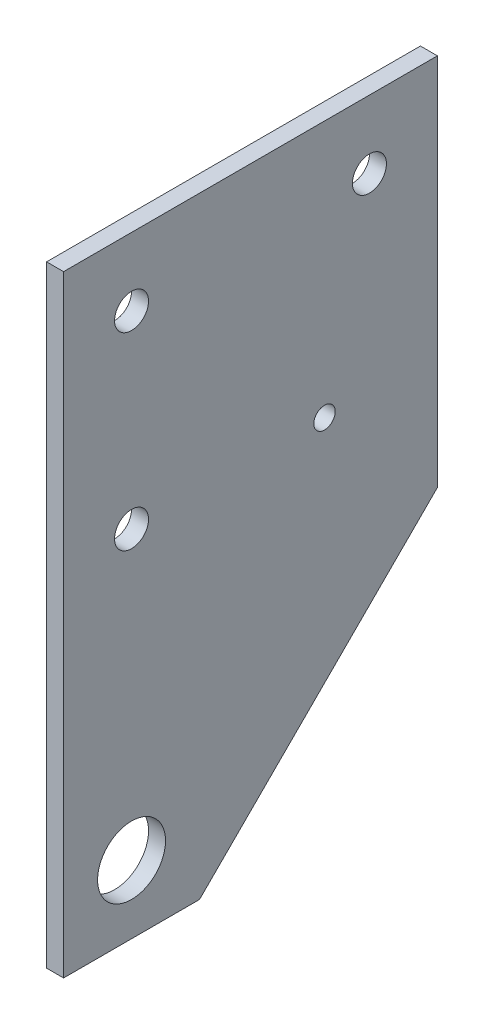
ISO-10303-21;
HEADER;
FILE_DESCRIPTION(('STEP AP214'),'2;1');
FILE_NAME('part.step','',(''),(''),'','','');
FILE_SCHEMA(('AUTOMOTIVE_DESIGN { 1 0 10303 214 1 1 1 1 }'));
ENDSEC;
DATA;
#1=APPLICATION_CONTEXT('core data for automotive mechanical design processes');
#2=APPLICATION_PROTOCOL_DEFINITION('international standard','automotive_design',2000,#1);
#3=PRODUCT_CONTEXT('',#1,'mechanical');
#4=PRODUCT('Part','Part','',(#3));
#5=PRODUCT_RELATED_PRODUCT_CATEGORY('part','',(#4));
#6=PRODUCT_DEFINITION_FORMATION('','',#4);
#7=PRODUCT_DEFINITION_CONTEXT('part definition',#1,'design');
#8=PRODUCT_DEFINITION('design','',#6,#7);
#9=PRODUCT_DEFINITION_SHAPE('','',#8);
#10=(LENGTH_UNIT() NAMED_UNIT(*) SI_UNIT(.MILLI.,.METRE.));
#11=(NAMED_UNIT(*) PLANE_ANGLE_UNIT() SI_UNIT($,.RADIAN.));
#12=(NAMED_UNIT(*) SI_UNIT($,.STERADIAN.) SOLID_ANGLE_UNIT());
#13=UNCERTAINTY_MEASURE_WITH_UNIT(LENGTH_MEASURE(1.E-05),#10,'distance_accuracy_value','');
#14=(GEOMETRIC_REPRESENTATION_CONTEXT(3) GLOBAL_UNCERTAINTY_ASSIGNED_CONTEXT((#13)) GLOBAL_UNIT_ASSIGNED_CONTEXT((#10,
#11,#12)) REPRESENTATION_CONTEXT('',''));
#15=CARTESIAN_POINT('',(0.,0.,0.));
#16=DIRECTION('',(0.,0.,1.));
#17=DIRECTION('',(1.,0.,0.));
#18=AXIS2_PLACEMENT_3D('',#15,#16,#17);
#19=CARTESIAN_POINT('',(3.175,-12.7,12.7));
#20=DIRECTION('',(1.,0.,0.));
#21=DIRECTION('',(0.,0.,-1.));
#22=AXIS2_PLACEMENT_3D('',#19,#20,#21);
#23=PLANE('',#22);
#24=CARTESIAN_POINT('',(3.175,88.9,-44.45));
#25=DIRECTION('',(1.,0.,0.));
#26=DIRECTION('',(0.,0.,-1.));
#27=AXIS2_PLACEMENT_3D('',#24,#25,#26);
#28=CIRCLE('',#27,3.175);
#29=CARTESIAN_POINT('',(3.175,88.9,-47.625));
#30=VERTEX_POINT('',#29);
#31=EDGE_CURVE('E177',#30,#30,#28,.T.);
#32=ORIENTED_EDGE('',*,*,#31,.F.);
#33=EDGE_LOOP('',(#32));
#34=FACE_BOUND('',#33,.T.);
#35=CARTESIAN_POINT('',(3.175,0.,0.));
#36=DIRECTION('',(1.,0.,0.));
#37=DIRECTION('',(0.,0.,-1.));
#38=AXIS2_PLACEMENT_3D('',#35,#36,#37);
#39=CIRCLE('',#38,6.35000000000008);
#40=CARTESIAN_POINT('',(3.175,0.,-6.35000000000008));
#41=VERTEX_POINT('',#40);
#42=EDGE_CURVE('E189',#41,#41,#39,.T.);
#43=ORIENTED_EDGE('',*,*,#42,.F.);
#44=EDGE_LOOP('',(#43));
#45=FACE_BOUND('',#44,.T.);
#46=DIRECTION('',(0.,-1.,0.));
#47=VECTOR('',#46,1.);
#48=CARTESIAN_POINT('',(3.175,101.6,12.7));
#49=LINE('',#48,#47);
#50=CARTESIAN_POINT('',(3.175,101.6,12.7));
#51=VERTEX_POINT('',#50);
#52=CARTESIAN_POINT('',(3.175,-12.7,12.7));
#53=VERTEX_POINT('',#52);
#54=EDGE_CURVE('E117',#51,#53,#49,.T.);
#55=ORIENTED_EDGE('',*,*,#54,.T.);
#56=DIRECTION('',(0.,0.,-1.));
#57=VECTOR('',#56,1.);
#58=CARTESIAN_POINT('',(3.175,-12.7,12.7));
#59=LINE('',#58,#57);
#60=CARTESIAN_POINT('',(3.175,-12.7,-12.7));
#61=VERTEX_POINT('',#60);
#62=EDGE_CURVE('E84',#53,#61,#59,.T.);
#63=ORIENTED_EDGE('',*,*,#62,.T.);
#64=DIRECTION('',(0.,0.707106781186548,-0.707106781186547));
#65=VECTOR('',#64,1.);
#66=CARTESIAN_POINT('',(3.175,-12.7,-12.7));
#67=LINE('',#66,#65);
#68=CARTESIAN_POINT('',(3.175,31.75,-57.15));
#69=VERTEX_POINT('',#68);
#70=EDGE_CURVE('E88',#61,#69,#67,.T.);
#71=ORIENTED_EDGE('',*,*,#70,.T.);
#72=DIRECTION('',(0.,1.,0.));
#73=VECTOR('',#72,1.);
#74=CARTESIAN_POINT('',(3.175,31.75,-57.15));
#75=LINE('',#74,#73);
#76=CARTESIAN_POINT('',(3.175,101.6,-57.15));
#77=VERTEX_POINT('',#76);
#78=EDGE_CURVE('E92',#69,#77,#75,.T.);
#79=ORIENTED_EDGE('',*,*,#78,.T.);
#80=DIRECTION('',(0.,0.,1.));
#81=VECTOR('',#80,1.);
#82=CARTESIAN_POINT('',(3.175,101.6,12.7));
#83=LINE('',#82,#81);
#84=EDGE_CURVE('E50',#77,#51,#83,.T.);
#85=ORIENTED_EDGE('',*,*,#84,.T.);
#86=EDGE_LOOP('',(#55,#63,#71,#79,#85));
#87=FACE_BOUND('',#86,.T.);
#88=CARTESIAN_POINT('',(3.175,53.6010427405374,-36.0553));
#89=DIRECTION('',(1.,0.,0.));
#90=DIRECTION('',(0.,0.,-1.));
#91=AXIS2_PLACEMENT_3D('',#88,#89,#90);
#92=CIRCLE('',#91,2.);
#93=CARTESIAN_POINT('',(3.175,53.6010427405374,-38.0553));
#94=VERTEX_POINT('',#93);
#95=EDGE_CURVE('E112',#94,#94,#92,.T.);
#96=ORIENTED_EDGE('',*,*,#95,.F.);
#97=EDGE_LOOP('',(#96));
#98=FACE_BOUND('',#97,.T.);
#99=CARTESIAN_POINT('',(3.175,88.9,0.));
#100=DIRECTION('',(1.,0.,0.));
#101=DIRECTION('',(0.,0.,-1.));
#102=AXIS2_PLACEMENT_3D('',#99,#100,#101);
#103=CIRCLE('',#102,3.175);
#104=CARTESIAN_POINT('',(3.175,88.9,-3.17499999999999));
#105=VERTEX_POINT('',#104);
#106=EDGE_CURVE('E183',#105,#105,#103,.T.);
#107=ORIENTED_EDGE('',*,*,#106,.F.);
#108=EDGE_LOOP('',(#107));
#109=FACE_BOUND('',#108,.T.);
#110=CARTESIAN_POINT('',(3.175,53.6010427405363,0.));
#111=DIRECTION('',(1.,0.,0.));
#112=DIRECTION('',(0.,0.,-1.));
#113=AXIS2_PLACEMENT_3D('',#110,#111,#112);
#114=CIRCLE('',#113,3.175);
#115=CARTESIAN_POINT('',(3.175,53.6010427405363,-3.175));
#116=VERTEX_POINT('',#115);
#117=EDGE_CURVE('E168',#116,#116,#114,.T.);
#118=ORIENTED_EDGE('',*,*,#117,.F.);
#119=EDGE_LOOP('',(#118));
#120=FACE_BOUND('',#119,.T.);
#121=ADVANCED_FACE('F33',(#34,#45,#87,#98,#109,#120),#23,.T.);
#122=CARTESIAN_POINT('',(0.,-12.7,12.7));
#123=DIRECTION('',(1.,0.,0.));
#124=DIRECTION('',(0.,0.,-1.));
#125=AXIS2_PLACEMENT_3D('',#122,#123,#124);
#126=PLANE('',#125);
#127=CARTESIAN_POINT('',(0.,88.9,-44.45));
#128=DIRECTION('',(1.,0.,0.));
#129=DIRECTION('',(0.,0.,-1.));
#130=AXIS2_PLACEMENT_3D('',#127,#128,#129);
#131=CIRCLE('',#130,3.175);
#132=CARTESIAN_POINT('',(0.,88.9,-47.625));
#133=VERTEX_POINT('',#132);
#134=EDGE_CURVE('E174',#133,#133,#131,.T.);
#135=ORIENTED_EDGE('',*,*,#134,.T.);
#136=EDGE_LOOP('',(#135));
#137=FACE_BOUND('',#136,.T.);
#138=CARTESIAN_POINT('',(0.,0.,0.));
#139=DIRECTION('',(1.,0.,0.));
#140=DIRECTION('',(0.,0.,-1.));
#141=AXIS2_PLACEMENT_3D('',#138,#139,#140);
#142=CIRCLE('',#141,6.35000000000008);
#143=CARTESIAN_POINT('',(0.,0.,-6.35000000000008));
#144=VERTEX_POINT('',#143);
#145=EDGE_CURVE('E186',#144,#144,#142,.T.);
#146=ORIENTED_EDGE('',*,*,#145,.T.);
#147=EDGE_LOOP('',(#146));
#148=FACE_BOUND('',#147,.T.);
#149=DIRECTION('',(0.,-1.,0.));
#150=VECTOR('',#149,1.);
#151=CARTESIAN_POINT('',(0.,101.6,12.7));
#152=LINE('',#151,#150);
#153=CARTESIAN_POINT('',(0.,101.6,12.7));
#154=VERTEX_POINT('',#153);
#155=CARTESIAN_POINT('',(0.,-12.7,12.7));
#156=VERTEX_POINT('',#155);
#157=EDGE_CURVE('E108',#154,#156,#152,.T.);
#158=ORIENTED_EDGE('',*,*,#157,.F.);
#159=DIRECTION('',(0.,0.,1.));
#160=VECTOR('',#159,1.);
#161=CARTESIAN_POINT('',(0.,101.6,12.7));
#162=LINE('',#161,#160);
#163=CARTESIAN_POINT('',(0.,101.6,-57.15));
#164=VERTEX_POINT('',#163);
#165=EDGE_CURVE('E76',#164,#154,#162,.T.);
#166=ORIENTED_EDGE('',*,*,#165,.F.);
#167=DIRECTION('',(0.,1.,0.));
#168=VECTOR('',#167,1.);
#169=CARTESIAN_POINT('',(0.,31.75,-57.15));
#170=LINE('',#169,#168);
#171=CARTESIAN_POINT('',(0.,31.75,-57.15));
#172=VERTEX_POINT('',#171);
#173=EDGE_CURVE('E70',#172,#164,#170,.T.);
#174=ORIENTED_EDGE('',*,*,#173,.F.);
#175=DIRECTION('',(0.,0.707106781186548,-0.707106781186547));
#176=VECTOR('',#175,1.);
#177=CARTESIAN_POINT('',(0.,-12.7,-12.7));
#178=LINE('',#177,#176);
#179=CARTESIAN_POINT('',(0.,-12.7,-12.7));
#180=VERTEX_POINT('',#179);
#181=EDGE_CURVE('E99',#180,#172,#178,.T.);
#182=ORIENTED_EDGE('',*,*,#181,.F.);
#183=DIRECTION('',(0.,0.,-1.));
#184=VECTOR('',#183,1.);
#185=CARTESIAN_POINT('',(0.,-12.7,12.7));
#186=LINE('',#185,#184);
#187=EDGE_CURVE('E111',#156,#180,#186,.T.);
#188=ORIENTED_EDGE('',*,*,#187,.F.);
#189=EDGE_LOOP('',(#158,#166,#174,#182,#188));
#190=FACE_BOUND('',#189,.T.);
#191=CARTESIAN_POINT('',(0.,53.6010427405374,-36.0553));
#192=DIRECTION('',(1.,0.,0.));
#193=DIRECTION('',(0.,0.,-1.));
#194=AXIS2_PLACEMENT_3D('',#191,#192,#193);
#195=CIRCLE('',#194,2.);
#196=CARTESIAN_POINT('',(0.,53.6010427405374,-38.0553));
#197=VERTEX_POINT('',#196);
#198=EDGE_CURVE('E192',#197,#197,#195,.T.);
#199=ORIENTED_EDGE('',*,*,#198,.T.);
#200=EDGE_LOOP('',(#199));
#201=FACE_BOUND('',#200,.T.);
#202=CARTESIAN_POINT('',(0.,88.9,0.));
#203=DIRECTION('',(1.,0.,0.));
#204=DIRECTION('',(0.,0.,-1.));
#205=AXIS2_PLACEMENT_3D('',#202,#203,#204);
#206=CIRCLE('',#205,3.175);
#207=CARTESIAN_POINT('',(0.,88.9,-3.17499999999999));
#208=VERTEX_POINT('',#207);
#209=EDGE_CURVE('E180',#208,#208,#206,.T.);
#210=ORIENTED_EDGE('',*,*,#209,.T.);
#211=EDGE_LOOP('',(#210));
#212=FACE_BOUND('',#211,.T.);
#213=CARTESIAN_POINT('',(0.,53.6010427405363,0.));
#214=DIRECTION('',(1.,0.,0.));
#215=DIRECTION('',(0.,0.,-1.));
#216=AXIS2_PLACEMENT_3D('',#213,#214,#215);
#217=CIRCLE('',#216,3.175);
#218=CARTESIAN_POINT('',(0.,53.6010427405363,-3.175));
#219=VERTEX_POINT('',#218);
#220=EDGE_CURVE('E171',#219,#219,#217,.T.);
#221=ORIENTED_EDGE('',*,*,#220,.T.);
#222=EDGE_LOOP('',(#221));
#223=FACE_BOUND('',#222,.T.);
#224=ADVANCED_FACE('F121',(#137,#148,#190,#201,#212,#223),#126,.F.);
#225=CARTESIAN_POINT('',(3.175,101.6,12.7));
#226=DIRECTION('',(0.,0.,-1.));
#227=DIRECTION('',(0.,1.,0.));
#228=AXIS2_PLACEMENT_3D('',#225,#226,#227);
#229=PLANE('',#228);
#230=ORIENTED_EDGE('',*,*,#157,.T.);
#231=DIRECTION('',(-1.,0.,0.));
#232=VECTOR('',#231,1.);
#233=CARTESIAN_POINT('',(3.175,-12.7,12.7));
#234=LINE('',#233,#232);
#235=EDGE_CURVE('E11',#53,#156,#234,.T.);
#236=ORIENTED_EDGE('',*,*,#235,.F.);
#237=ORIENTED_EDGE('',*,*,#54,.F.);
#238=DIRECTION('',(-1.,0.,0.));
#239=VECTOR('',#238,1.);
#240=CARTESIAN_POINT('',(3.175,101.6,12.7));
#241=LINE('',#240,#239);
#242=EDGE_CURVE('E104',#51,#154,#241,.T.);
#243=ORIENTED_EDGE('',*,*,#242,.T.);
#244=EDGE_LOOP('',(#230,#236,#237,#243));
#245=FACE_BOUND('',#244,.T.);
#246=ADVANCED_FACE('F35',(#245),#229,.F.);
#247=CARTESIAN_POINT('',(3.175,-12.7,12.7));
#248=DIRECTION('',(0.,1.,0.));
#249=DIRECTION('',(0.,0.,1.));
#250=AXIS2_PLACEMENT_3D('',#247,#248,#249);
#251=PLANE('',#250);
#252=ORIENTED_EDGE('',*,*,#187,.T.);
#253=DIRECTION('',(-1.,0.,0.));
#254=VECTOR('',#253,1.);
#255=CARTESIAN_POINT('',(3.175,-12.7,-12.7));
#256=LINE('',#255,#254);
#257=EDGE_CURVE('E42',#61,#180,#256,.T.);
#258=ORIENTED_EDGE('',*,*,#257,.F.);
#259=ORIENTED_EDGE('',*,*,#62,.F.);
#260=ORIENTED_EDGE('',*,*,#235,.T.);
#261=EDGE_LOOP('',(#252,#258,#259,#260));
#262=FACE_BOUND('',#261,.T.);
#263=ADVANCED_FACE('F249',(#262),#251,.F.);
#264=CARTESIAN_POINT('',(3.175,-12.7,-12.7));
#265=DIRECTION('',(0.,0.707106781186547,0.707106781186548));
#266=DIRECTION('',(0.,-0.707106781186548,0.707106781186547));
#267=AXIS2_PLACEMENT_3D('',#264,#265,#266);
#268=PLANE('',#267);
#269=ORIENTED_EDGE('',*,*,#181,.T.);
#270=DIRECTION('',(-1.,0.,0.));
#271=VECTOR('',#270,1.);
#272=CARTESIAN_POINT('',(3.175,31.75,-57.15));
#273=LINE('',#272,#271);
#274=EDGE_CURVE('E96',#69,#172,#273,.T.);
#275=ORIENTED_EDGE('',*,*,#274,.F.);
#276=ORIENTED_EDGE('',*,*,#70,.F.);
#277=ORIENTED_EDGE('',*,*,#257,.T.);
#278=EDGE_LOOP('',(#269,#275,#276,#277));
#279=FACE_BOUND('',#278,.T.);
#280=ADVANCED_FACE('F97',(#279),#268,.F.);
#281=CARTESIAN_POINT('',(3.175,31.75,-57.15));
#282=DIRECTION('',(0.,0.,1.));
#283=DIRECTION('',(1.,0.,0.));
#284=AXIS2_PLACEMENT_3D('',#281,#282,#283);
#285=PLANE('',#284);
#286=ORIENTED_EDGE('',*,*,#173,.T.);
#287=DIRECTION('',(-1.,0.,0.));
#288=VECTOR('',#287,1.);
#289=CARTESIAN_POINT('',(3.175,101.6,-57.15));
#290=LINE('',#289,#288);
#291=EDGE_CURVE('E100',#77,#164,#290,.T.);
#292=ORIENTED_EDGE('',*,*,#291,.F.);
#293=ORIENTED_EDGE('',*,*,#78,.F.);
#294=ORIENTED_EDGE('',*,*,#274,.T.);
#295=EDGE_LOOP('',(#286,#292,#293,#294));
#296=FACE_BOUND('',#295,.T.);
#297=ADVANCED_FACE('F102',(#296),#285,.F.);
#298=CARTESIAN_POINT('',(3.175,101.6,12.7));
#299=DIRECTION('',(0.,-1.,0.));
#300=DIRECTION('',(0.,0.,-1.));
#301=AXIS2_PLACEMENT_3D('',#298,#299,#300);
#302=PLANE('',#301);
#303=ORIENTED_EDGE('',*,*,#165,.T.);
#304=ORIENTED_EDGE('',*,*,#242,.F.);
#305=ORIENTED_EDGE('',*,*,#84,.F.);
#306=ORIENTED_EDGE('',*,*,#291,.T.);
#307=EDGE_LOOP('',(#303,#304,#305,#306));
#308=FACE_BOUND('',#307,.T.);
#309=ADVANCED_FACE('F126',(#308),#302,.F.);
#310=CARTESIAN_POINT('',(3.175,53.6010427405374,-36.0553));
#311=DIRECTION('',(-1.,0.,0.));
#312=DIRECTION('',(0.,0.,1.));
#313=AXIS2_PLACEMENT_3D('',#310,#311,#312);
#314=CYLINDRICAL_SURFACE('',#313,2.);
#315=ORIENTED_EDGE('',*,*,#95,.T.);
#316=EDGE_LOOP('',(#315));
#317=FACE_BOUND('',#316,.T.);
#318=ORIENTED_EDGE('',*,*,#198,.F.);
#319=EDGE_LOOP('',(#318));
#320=FACE_BOUND('',#319,.T.);
#321=ADVANCED_FACE('F128',(#317,#320),#314,.F.);
#322=CARTESIAN_POINT('',(3.175,0.,0.));
#323=DIRECTION('',(-1.,0.,0.));
#324=DIRECTION('',(0.,0.,1.));
#325=AXIS2_PLACEMENT_3D('',#322,#323,#324);
#326=CYLINDRICAL_SURFACE('',#325,6.35000000000008);
#327=ORIENTED_EDGE('',*,*,#42,.T.);
#328=EDGE_LOOP('',(#327));
#329=FACE_BOUND('',#328,.T.);
#330=ORIENTED_EDGE('',*,*,#145,.F.);
#331=EDGE_LOOP('',(#330));
#332=FACE_BOUND('',#331,.T.);
#333=ADVANCED_FACE('F134',(#329,#332),#326,.F.);
#334=CARTESIAN_POINT('',(3.175,88.9,0.));
#335=DIRECTION('',(-1.,0.,0.));
#336=DIRECTION('',(0.,0.,1.));
#337=AXIS2_PLACEMENT_3D('',#334,#335,#336);
#338=CYLINDRICAL_SURFACE('',#337,3.175);
#339=ORIENTED_EDGE('',*,*,#106,.T.);
#340=EDGE_LOOP('',(#339));
#341=FACE_BOUND('',#340,.T.);
#342=ORIENTED_EDGE('',*,*,#209,.F.);
#343=EDGE_LOOP('',(#342));
#344=FACE_BOUND('',#343,.T.);
#345=ADVANCED_FACE('F151',(#341,#344),#338,.F.);
#346=CARTESIAN_POINT('',(3.175,88.9,-44.45));
#347=DIRECTION('',(-1.,0.,0.));
#348=DIRECTION('',(0.,0.,1.));
#349=AXIS2_PLACEMENT_3D('',#346,#347,#348);
#350=CYLINDRICAL_SURFACE('',#349,3.175);
#351=ORIENTED_EDGE('',*,*,#31,.T.);
#352=EDGE_LOOP('',(#351));
#353=FACE_BOUND('',#352,.T.);
#354=ORIENTED_EDGE('',*,*,#134,.F.);
#355=EDGE_LOOP('',(#354));
#356=FACE_BOUND('',#355,.T.);
#357=ADVANCED_FACE('F155',(#353,#356),#350,.F.);
#358=CARTESIAN_POINT('',(3.175,53.6010427405363,0.));
#359=DIRECTION('',(-1.,0.,0.));
#360=DIRECTION('',(0.,0.,1.));
#361=AXIS2_PLACEMENT_3D('',#358,#359,#360);
#362=CYLINDRICAL_SURFACE('',#361,3.175);
#363=ORIENTED_EDGE('',*,*,#117,.T.);
#364=EDGE_LOOP('',(#363));
#365=FACE_BOUND('',#364,.T.);
#366=ORIENTED_EDGE('',*,*,#220,.F.);
#367=EDGE_LOOP('',(#366));
#368=FACE_BOUND('',#367,.T.);
#369=ADVANCED_FACE('F159',(#365,#368),#362,.F.);
#370=CLOSED_SHELL('',(#121,#224,#246,#263,#280,#297,#309,#321,#333,#345,#357,#369));
#371=MANIFOLD_SOLID_BREP('B2',#370);
#372=ADVANCED_BREP_SHAPE_REPRESENTATION('',(#18,#371),#14);
#373=SHAPE_DEFINITION_REPRESENTATION(#9,#372);
ENDSEC;
END-ISO-10303-21;
